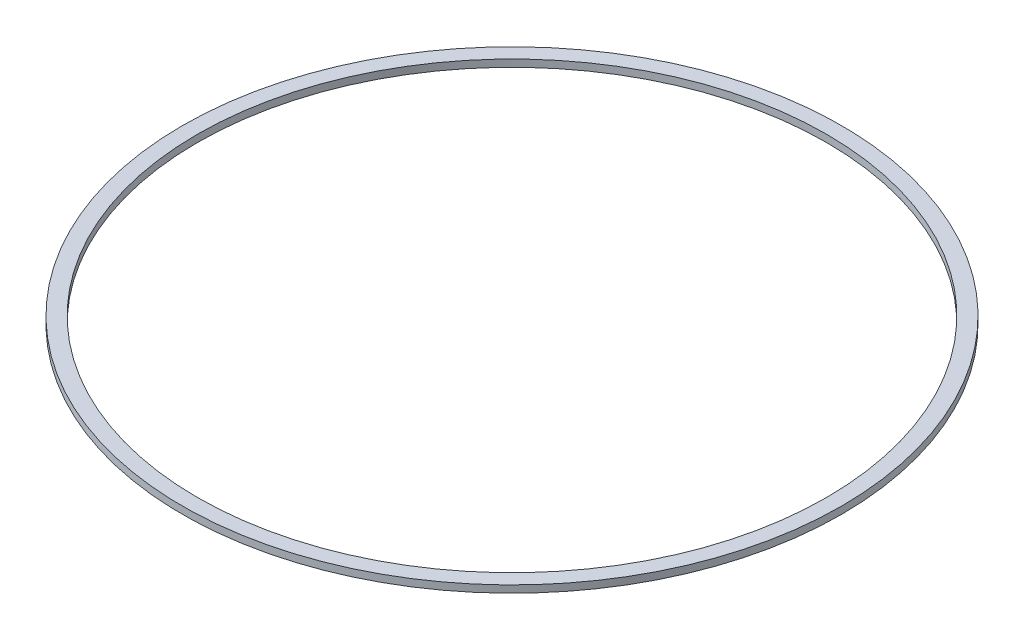
ISO-10303-21;
HEADER;
FILE_DESCRIPTION(('STEP AP214'),'2;1');
FILE_NAME('part.step','',(''),(''),'','','');
FILE_SCHEMA(('AUTOMOTIVE_DESIGN { 1 0 10303 214 1 1 1 1 }'));
ENDSEC;
DATA;
#1=APPLICATION_CONTEXT('core data for automotive mechanical design processes');
#2=APPLICATION_PROTOCOL_DEFINITION('international standard','automotive_design',2000,#1);
#3=PRODUCT_CONTEXT('',#1,'mechanical');
#4=PRODUCT('Part','Part','',(#3));
#5=PRODUCT_RELATED_PRODUCT_CATEGORY('part','',(#4));
#6=PRODUCT_DEFINITION_FORMATION('','',#4);
#7=PRODUCT_DEFINITION_CONTEXT('part definition',#1,'design');
#8=PRODUCT_DEFINITION('design','',#6,#7);
#9=PRODUCT_DEFINITION_SHAPE('','',#8);
#10=(LENGTH_UNIT() NAMED_UNIT(*) SI_UNIT(.MILLI.,.METRE.));
#11=(NAMED_UNIT(*) PLANE_ANGLE_UNIT() SI_UNIT($,.RADIAN.));
#12=(NAMED_UNIT(*) SI_UNIT($,.STERADIAN.) SOLID_ANGLE_UNIT());
#13=UNCERTAINTY_MEASURE_WITH_UNIT(LENGTH_MEASURE(1.E-05),#10,'distance_accuracy_value','');
#14=(GEOMETRIC_REPRESENTATION_CONTEXT(3) GLOBAL_UNCERTAINTY_ASSIGNED_CONTEXT((#13)) GLOBAL_UNIT_ASSIGNED_CONTEXT((#10,
#11,#12)) REPRESENTATION_CONTEXT('',''));
#15=CARTESIAN_POINT('',(0.,0.,0.));
#16=DIRECTION('',(0.,0.,1.));
#17=DIRECTION('',(1.,0.,0.));
#18=AXIS2_PLACEMENT_3D('',#15,#16,#17);
#19=CARTESIAN_POINT('',(0.,0.,0.));
#20=DIRECTION('',(0.,-1.,0.));
#21=DIRECTION('',(1.,0.,0.));
#22=AXIS2_PLACEMENT_3D('',#19,#20,#21);
#23=CYLINDRICAL_SURFACE('',#22,55.);
#24=CARTESIAN_POINT('',(0.,8.1,0.));
#25=DIRECTION('',(0.,-1.,0.));
#26=DIRECTION('',(1.,0.,0.));
#27=AXIS2_PLACEMENT_3D('',#24,#25,#26);
#28=CIRCLE('',#27,55.);
#29=CARTESIAN_POINT('',(55.,8.1,0.));
#30=VERTEX_POINT('',#29);
#31=EDGE_CURVE('E10',#30,#30,#28,.T.);
#32=ORIENTED_EDGE('',*,*,#31,.F.);
#33=EDGE_LOOP('',(#32));
#34=FACE_BOUND('',#33,.T.);
#35=CARTESIAN_POINT('',(0.,9.3,0.));
#36=DIRECTION('',(0.,-1.,0.));
#37=DIRECTION('',(1.,0.,0.));
#38=AXIS2_PLACEMENT_3D('',#35,#36,#37);
#39=CIRCLE('',#38,55.);
#40=CARTESIAN_POINT('',(55.,9.3,0.));
#41=VERTEX_POINT('',#40);
#42=EDGE_CURVE('E46',#41,#41,#39,.T.);
#43=ORIENTED_EDGE('',*,*,#42,.T.);
#44=EDGE_LOOP('',(#43));
#45=FACE_BOUND('',#44,.T.);
#46=ADVANCED_FACE('F32',(#34,#45),#23,.T.);
#47=CARTESIAN_POINT('',(-55.,8.1,0.));
#48=DIRECTION('',(0.,1.,0.));
#49=DIRECTION('',(-1.,0.,0.));
#50=AXIS2_PLACEMENT_3D('',#47,#48,#49);
#51=PLANE('',#50);
#52=CARTESIAN_POINT('',(0.,8.1,0.));
#53=DIRECTION('',(0.,-1.,0.));
#54=DIRECTION('',(1.,0.,0.));
#55=AXIS2_PLACEMENT_3D('',#52,#53,#54);
#56=CIRCLE('',#55,52.5);
#57=CARTESIAN_POINT('',(52.5,8.1,0.));
#58=VERTEX_POINT('',#57);
#59=EDGE_CURVE('E38',#58,#58,#56,.T.);
#60=ORIENTED_EDGE('',*,*,#59,.F.);
#61=EDGE_LOOP('',(#60));
#62=FACE_BOUND('',#61,.T.);
#63=ORIENTED_EDGE('',*,*,#31,.T.);
#64=EDGE_LOOP('',(#63));
#65=FACE_BOUND('',#64,.T.);
#66=ADVANCED_FACE('F61',(#62,#65),#51,.F.);
#67=CARTESIAN_POINT('',(0.,0.,0.));
#68=DIRECTION('',(0.,-1.,0.));
#69=DIRECTION('',(1.,0.,0.));
#70=AXIS2_PLACEMENT_3D('',#67,#68,#69);
#71=CYLINDRICAL_SURFACE('',#70,52.5);
#72=CARTESIAN_POINT('',(0.,9.3,0.));
#73=DIRECTION('',(0.,-1.,0.));
#74=DIRECTION('',(1.,0.,0.));
#75=AXIS2_PLACEMENT_3D('',#72,#73,#74);
#76=CIRCLE('',#75,52.5);
#77=CARTESIAN_POINT('',(52.5,9.3,0.));
#78=VERTEX_POINT('',#77);
#79=EDGE_CURVE('E42',#78,#78,#76,.T.);
#80=ORIENTED_EDGE('',*,*,#79,.F.);
#81=EDGE_LOOP('',(#80));
#82=FACE_BOUND('',#81,.T.);
#83=ORIENTED_EDGE('',*,*,#59,.T.);
#84=EDGE_LOOP('',(#83));
#85=FACE_BOUND('',#84,.T.);
#86=ADVANCED_FACE('F56',(#82,#85),#71,.F.);
#87=CARTESIAN_POINT('',(-52.5,9.3,0.));
#88=DIRECTION('',(0.,-1.,0.));
#89=DIRECTION('',(1.,0.,0.));
#90=AXIS2_PLACEMENT_3D('',#87,#88,#89);
#91=PLANE('',#90);
#92=ORIENTED_EDGE('',*,*,#42,.F.);
#93=EDGE_LOOP('',(#92));
#94=FACE_BOUND('',#93,.T.);
#95=ORIENTED_EDGE('',*,*,#79,.T.);
#96=EDGE_LOOP('',(#95));
#97=FACE_BOUND('',#96,.T.);
#98=ADVANCED_FACE('F53',(#94,#97),#91,.F.);
#99=CLOSED_SHELL('',(#46,#66,#86,#98));
#100=MANIFOLD_SOLID_BREP('B2',#99);
#101=ADVANCED_BREP_SHAPE_REPRESENTATION('',(#18,#100),#14);
#102=SHAPE_DEFINITION_REPRESENTATION(#9,#101);
ENDSEC;
END-ISO-10303-21;
